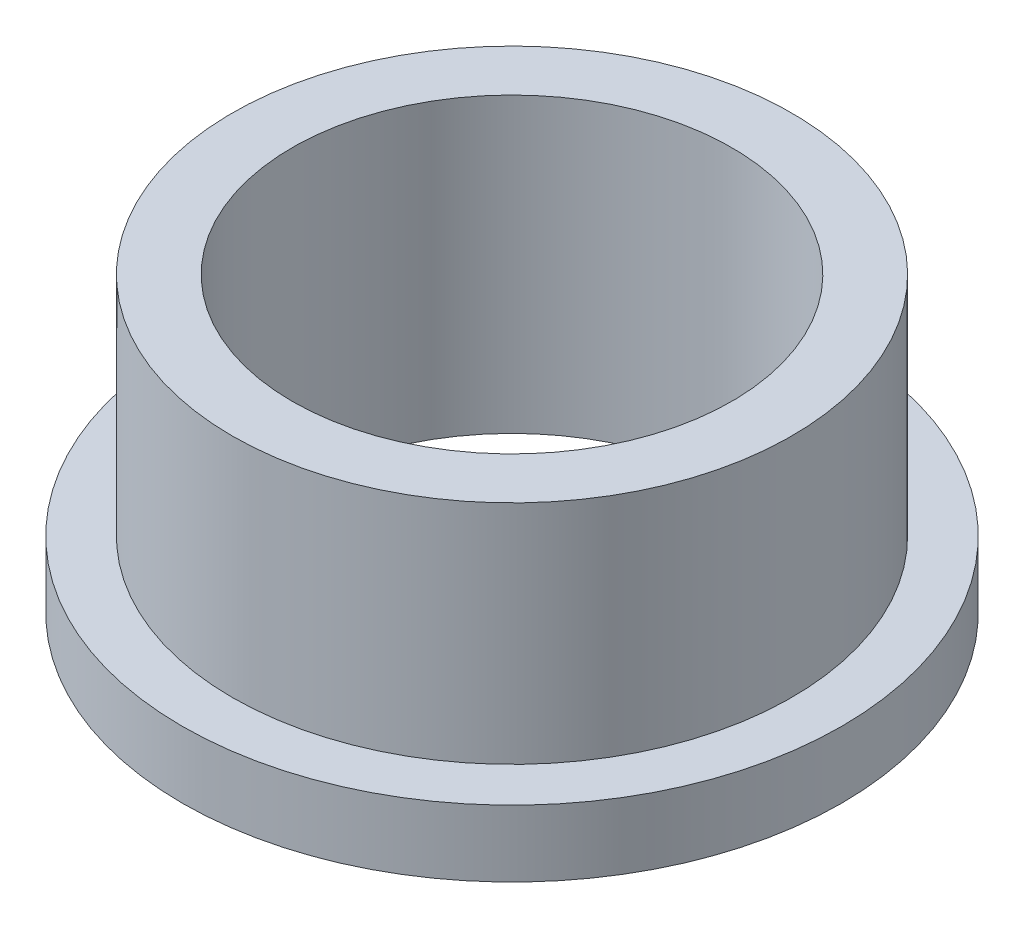
ISO-10303-21;
HEADER;
FILE_DESCRIPTION(('STEP AP214'),'2;1');
FILE_NAME('part.step','',(''),(''),'','','');
FILE_SCHEMA(('AUTOMOTIVE_DESIGN { 1 0 10303 214 1 1 1 1 }'));
ENDSEC;
DATA;
#1=APPLICATION_CONTEXT('core data for automotive mechanical design processes');
#2=APPLICATION_PROTOCOL_DEFINITION('international standard','automotive_design',2000,#1);
#3=PRODUCT_CONTEXT('',#1,'mechanical');
#4=PRODUCT('Part','Part','',(#3));
#5=PRODUCT_RELATED_PRODUCT_CATEGORY('part','',(#4));
#6=PRODUCT_DEFINITION_FORMATION('','',#4);
#7=PRODUCT_DEFINITION_CONTEXT('part definition',#1,'design');
#8=PRODUCT_DEFINITION('design','',#6,#7);
#9=PRODUCT_DEFINITION_SHAPE('','',#8);
#10=(LENGTH_UNIT() NAMED_UNIT(*) SI_UNIT(.MILLI.,.METRE.));
#11=(NAMED_UNIT(*) PLANE_ANGLE_UNIT() SI_UNIT($,.RADIAN.));
#12=(NAMED_UNIT(*) SI_UNIT($,.STERADIAN.) SOLID_ANGLE_UNIT());
#13=UNCERTAINTY_MEASURE_WITH_UNIT(LENGTH_MEASURE(1.E-05),#10,'distance_accuracy_value','');
#14=(GEOMETRIC_REPRESENTATION_CONTEXT(3) GLOBAL_UNCERTAINTY_ASSIGNED_CONTEXT((#13)) GLOBAL_UNIT_ASSIGNED_CONTEXT((#10,
#11,#12)) REPRESENTATION_CONTEXT('',''));
#15=CARTESIAN_POINT('',(0.,0.,0.));
#16=DIRECTION('',(0.,0.,1.));
#17=DIRECTION('',(1.,0.,0.));
#18=AXIS2_PLACEMENT_3D('',#15,#16,#17);
#19=CARTESIAN_POINT('',(0.,4.62,0.));
#20=DIRECTION('',(0.,1.,0.));
#21=DIRECTION('',(0.,0.,1.));
#22=AXIS2_PLACEMENT_3D('',#19,#20,#21);
#23=CYLINDRICAL_SURFACE('',#22,4.95);
#24=CARTESIAN_POINT('',(0.,0.,0.));
#25=DIRECTION('',(0.,1.,0.));
#26=DIRECTION('',(0.,0.,1.));
#27=AXIS2_PLACEMENT_3D('',#24,#25,#26);
#28=CIRCLE('',#27,4.95);
#29=CARTESIAN_POINT('',(0.,0.,4.95));
#30=VERTEX_POINT('',#29);
#31=EDGE_CURVE('E51',#30,#30,#28,.T.);
#32=ORIENTED_EDGE('',*,*,#31,.T.);
#33=EDGE_LOOP('',(#32));
#34=FACE_BOUND('',#33,.T.);
#35=CARTESIAN_POINT('',(0.,1.,0.));
#36=DIRECTION('',(0.,1.,0.));
#37=DIRECTION('',(0.,0.,1.));
#38=AXIS2_PLACEMENT_3D('',#35,#36,#37);
#39=CIRCLE('',#38,4.95);
#40=CARTESIAN_POINT('',(0.,1.,4.95));
#41=VERTEX_POINT('',#40);
#42=EDGE_CURVE('E10',#41,#41,#39,.T.);
#43=ORIENTED_EDGE('',*,*,#42,.F.);
#44=EDGE_LOOP('',(#43));
#45=FACE_BOUND('',#44,.T.);
#46=ADVANCED_FACE('F29',(#34,#45),#23,.T.);
#47=CARTESIAN_POINT('',(-4.95,1.,0.));
#48=DIRECTION('',(0.,1.,0.));
#49=DIRECTION('',(0.,0.,1.));
#50=AXIS2_PLACEMENT_3D('',#47,#48,#49);
#51=PLANE('',#50);
#52=ORIENTED_EDGE('',*,*,#42,.T.);
#53=EDGE_LOOP('',(#52));
#54=FACE_BOUND('',#53,.T.);
#55=CARTESIAN_POINT('',(0.,1.,0.));
#56=DIRECTION('',(0.,1.,0.));
#57=DIRECTION('',(0.,0.,1.));
#58=AXIS2_PLACEMENT_3D('',#55,#56,#57);
#59=CIRCLE('',#58,4.2);
#60=CARTESIAN_POINT('',(0.,1.,4.2));
#61=VERTEX_POINT('',#60);
#62=EDGE_CURVE('E35',#61,#61,#59,.T.);
#63=ORIENTED_EDGE('',*,*,#62,.F.);
#64=EDGE_LOOP('',(#63));
#65=FACE_BOUND('',#64,.T.);
#66=ADVANCED_FACE('F69',(#54,#65),#51,.T.);
#67=CARTESIAN_POINT('',(0.,4.62,0.));
#68=DIRECTION('',(0.,1.,0.));
#69=DIRECTION('',(0.,0.,1.));
#70=AXIS2_PLACEMENT_3D('',#67,#68,#69);
#71=CYLINDRICAL_SURFACE('',#70,4.2);
#72=ORIENTED_EDGE('',*,*,#62,.T.);
#73=EDGE_LOOP('',(#72));
#74=FACE_BOUND('',#73,.T.);
#75=CARTESIAN_POINT('',(0.,4.4,0.));
#76=DIRECTION('',(0.,1.,0.));
#77=DIRECTION('',(0.,0.,1.));
#78=AXIS2_PLACEMENT_3D('',#75,#76,#77);
#79=CIRCLE('',#78,4.2);
#80=CARTESIAN_POINT('',(0.,4.4,4.2));
#81=VERTEX_POINT('',#80);
#82=EDGE_CURVE('E39',#81,#81,#79,.T.);
#83=ORIENTED_EDGE('',*,*,#82,.F.);
#84=EDGE_LOOP('',(#83));
#85=FACE_BOUND('',#84,.T.);
#86=ADVANCED_FACE('F73',(#74,#85),#71,.T.);
#87=CARTESIAN_POINT('',(-4.2,4.4,0.));
#88=DIRECTION('',(0.,1.,0.));
#89=DIRECTION('',(0.,0.,1.));
#90=AXIS2_PLACEMENT_3D('',#87,#88,#89);
#91=PLANE('',#90);
#92=ORIENTED_EDGE('',*,*,#82,.T.);
#93=EDGE_LOOP('',(#92));
#94=FACE_BOUND('',#93,.T.);
#95=CARTESIAN_POINT('',(0.,4.4,0.));
#96=DIRECTION('',(0.,1.,0.));
#97=DIRECTION('',(0.,0.,1.));
#98=AXIS2_PLACEMENT_3D('',#95,#96,#97);
#99=CIRCLE('',#98,3.3);
#100=CARTESIAN_POINT('',(0.,4.4,3.3));
#101=VERTEX_POINT('',#100);
#102=EDGE_CURVE('E43',#101,#101,#99,.T.);
#103=ORIENTED_EDGE('',*,*,#102,.F.);
#104=EDGE_LOOP('',(#103));
#105=FACE_BOUND('',#104,.T.);
#106=ADVANCED_FACE('F65',(#94,#105),#91,.T.);
#107=CARTESIAN_POINT('',(0.,4.62,0.));
#108=DIRECTION('',(0.,1.,0.));
#109=DIRECTION('',(0.,0.,1.));
#110=AXIS2_PLACEMENT_3D('',#107,#108,#109);
#111=CYLINDRICAL_SURFACE('',#110,3.3);
#112=ORIENTED_EDGE('',*,*,#102,.T.);
#113=EDGE_LOOP('',(#112));
#114=FACE_BOUND('',#113,.T.);
#115=CARTESIAN_POINT('',(0.,0.,0.));
#116=DIRECTION('',(0.,1.,0.));
#117=DIRECTION('',(0.,0.,1.));
#118=AXIS2_PLACEMENT_3D('',#115,#116,#117);
#119=CIRCLE('',#118,3.3);
#120=CARTESIAN_POINT('',(0.,0.,3.3));
#121=VERTEX_POINT('',#120);
#122=EDGE_CURVE('E48',#121,#121,#119,.T.);
#123=ORIENTED_EDGE('',*,*,#122,.F.);
#124=EDGE_LOOP('',(#123));
#125=FACE_BOUND('',#124,.T.);
#126=ADVANCED_FACE('F59',(#114,#125),#111,.F.);
#127=CARTESIAN_POINT('',(-4.95,0.,0.));
#128=DIRECTION('',(0.,-1.,0.));
#129=DIRECTION('',(0.,0.,-1.));
#130=AXIS2_PLACEMENT_3D('',#127,#128,#129);
#131=PLANE('',#130);
#132=ORIENTED_EDGE('',*,*,#122,.T.);
#133=EDGE_LOOP('',(#132));
#134=FACE_BOUND('',#133,.T.);
#135=ORIENTED_EDGE('',*,*,#31,.F.);
#136=EDGE_LOOP('',(#135));
#137=FACE_BOUND('',#136,.T.);
#138=ADVANCED_FACE('F57',(#134,#137),#131,.T.);
#139=CLOSED_SHELL('',(#46,#66,#86,#106,#126,#138));
#140=MANIFOLD_SOLID_BREP('B2',#139);
#141=ADVANCED_BREP_SHAPE_REPRESENTATION('',(#18,#140),#14);
#142=SHAPE_DEFINITION_REPRESENTATION(#9,#141);
ENDSEC;
END-ISO-10303-21;
